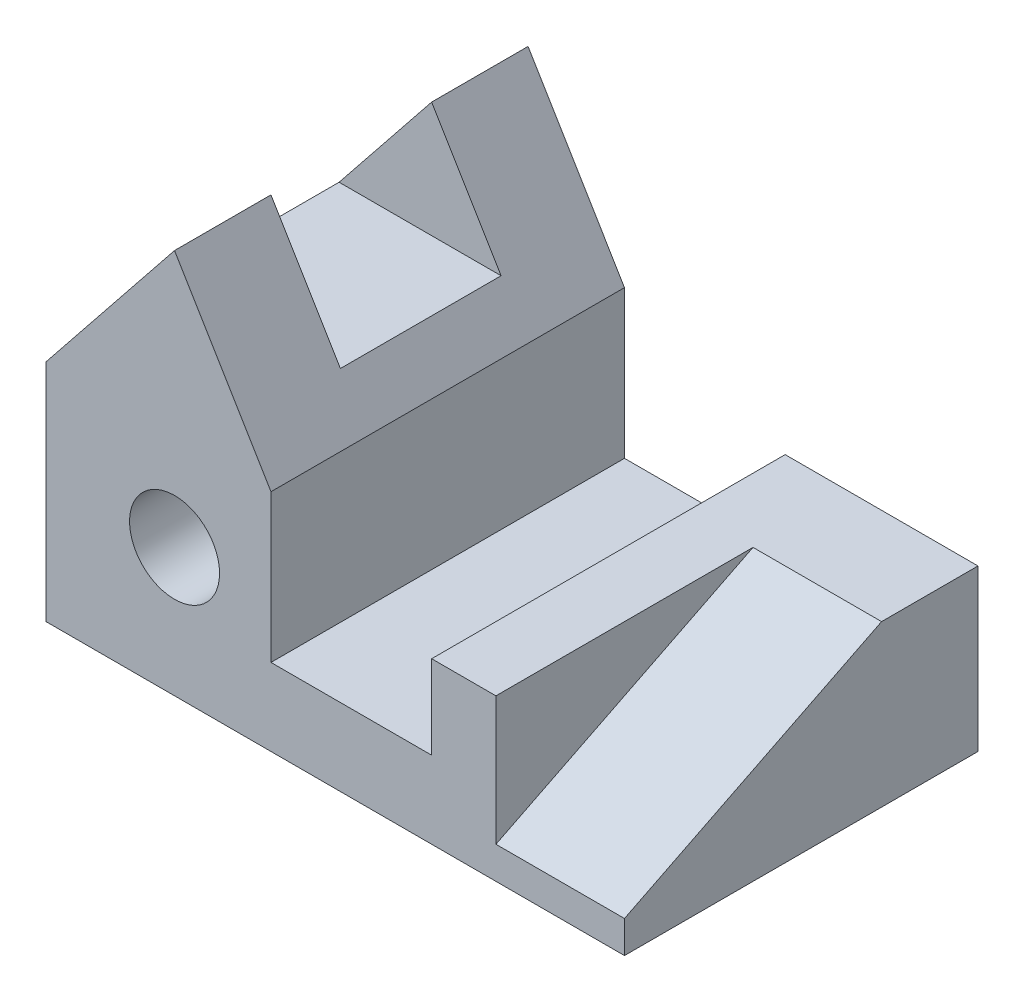
ISO-10303-21;
HEADER;
FILE_DESCRIPTION(('STEP AP214'),'2;1');
FILE_NAME('part.step','',(''),(''),'','','');
FILE_SCHEMA(('AUTOMOTIVE_DESIGN { 1 0 10303 214 1 1 1 1 }'));
ENDSEC;
DATA;
#1=APPLICATION_CONTEXT('core data for automotive mechanical design processes');
#2=APPLICATION_PROTOCOL_DEFINITION('international standard','automotive_design',2000,#1);
#3=PRODUCT_CONTEXT('',#1,'mechanical');
#4=PRODUCT('Part','Part','',(#3));
#5=PRODUCT_RELATED_PRODUCT_CATEGORY('part','',(#4));
#6=PRODUCT_DEFINITION_FORMATION('','',#4);
#7=PRODUCT_DEFINITION_CONTEXT('part definition',#1,'design');
#8=PRODUCT_DEFINITION('design','',#6,#7);
#9=PRODUCT_DEFINITION_SHAPE('','',#8);
#10=(LENGTH_UNIT() NAMED_UNIT(*) SI_UNIT(.MILLI.,.METRE.));
#11=(NAMED_UNIT(*) PLANE_ANGLE_UNIT() SI_UNIT($,.RADIAN.));
#12=(NAMED_UNIT(*) SI_UNIT($,.STERADIAN.) SOLID_ANGLE_UNIT());
#13=UNCERTAINTY_MEASURE_WITH_UNIT(LENGTH_MEASURE(1.E-05),#10,'distance_accuracy_value','');
#14=(GEOMETRIC_REPRESENTATION_CONTEXT(3) GLOBAL_UNCERTAINTY_ASSIGNED_CONTEXT((#13)) GLOBAL_UNIT_ASSIGNED_CONTEXT((#10,
#11,#12)) REPRESENTATION_CONTEXT('',''));
#15=CARTESIAN_POINT('',(0.,0.,0.));
#16=DIRECTION('',(0.,0.,1.));
#17=DIRECTION('',(1.,0.,0.));
#18=AXIS2_PLACEMENT_3D('',#15,#16,#17);
#19=CARTESIAN_POINT('',(60.,25.,55.));
#20=DIRECTION('',(0.,-1.,0.));
#21=DIRECTION('',(0.,0.,-1.));
#22=AXIS2_PLACEMENT_3D('',#19,#20,#21);
#23=PLANE('',#22);
#24=DIRECTION('',(-1.,0.,0.));
#25=VECTOR('',#24,1.);
#26=CARTESIAN_POINT('',(241.683263743895,25.,15.));
#27=LINE('',#26,#25);
#28=CARTESIAN_POINT('',(90.,25.,15.));
#29=VERTEX_POINT('',#28);
#30=CARTESIAN_POINT('',(70.,25.,15.));
#31=VERTEX_POINT('',#30);
#32=EDGE_CURVE('E60',#29,#31,#27,.T.);
#33=ORIENTED_EDGE('',*,*,#32,.F.);
#34=DIRECTION('',(0.,0.,-1.));
#35=VECTOR('',#34,1.);
#36=CARTESIAN_POINT('',(90.,25.,55.));
#37=LINE('',#36,#35);
#38=CARTESIAN_POINT('',(90.,25.,0.));
#39=VERTEX_POINT('',#38);
#40=EDGE_CURVE('E241',#29,#39,#37,.T.);
#41=ORIENTED_EDGE('',*,*,#40,.T.);
#42=DIRECTION('',(-1.,0.,0.));
#43=VECTOR('',#42,1.);
#44=CARTESIAN_POINT('',(60.,25.,0.));
#45=LINE('',#44,#43);
#46=CARTESIAN_POINT('',(60.,25.,0.));
#47=VERTEX_POINT('',#46);
#48=EDGE_CURVE('E208',#39,#47,#45,.T.);
#49=ORIENTED_EDGE('',*,*,#48,.T.);
#50=DIRECTION('',(0.,0.,-1.));
#51=VECTOR('',#50,1.);
#52=CARTESIAN_POINT('',(60.,25.,55.));
#53=LINE('',#52,#51);
#54=CARTESIAN_POINT('',(60.,25.,55.));
#55=VERTEX_POINT('',#54);
#56=EDGE_CURVE('E238',#55,#47,#53,.T.);
#57=ORIENTED_EDGE('',*,*,#56,.F.);
#58=DIRECTION('',(-1.,0.,0.));
#59=VECTOR('',#58,1.);
#60=CARTESIAN_POINT('',(60.,25.,55.));
#61=LINE('',#60,#59);
#62=CARTESIAN_POINT('',(70.,25.,55.));
#63=VERTEX_POINT('',#62);
#64=EDGE_CURVE('E188',#63,#55,#61,.T.);
#65=ORIENTED_EDGE('',*,*,#64,.F.);
#66=DIRECTION('',(0.,0.,-1.));
#67=VECTOR('',#66,1.);
#68=CARTESIAN_POINT('',(70.,25.,55.));
#69=LINE('',#68,#67);
#70=EDGE_CURVE('E156',#63,#31,#69,.T.);
#71=ORIENTED_EDGE('',*,*,#70,.T.);
#72=EDGE_LOOP('',(#33,#41,#49,#57,#65,#71));
#73=FACE_BOUND('',#72,.T.);
#74=ADVANCED_FACE('F37',(#73),#23,.F.);
#75=CARTESIAN_POINT('',(0.,0.,55.));
#76=DIRECTION('',(0.,0.,-1.));
#77=DIRECTION('',(-1.,0.,0.));
#78=AXIS2_PLACEMENT_3D('',#75,#76,#77);
#79=PLANE('',#78);
#80=DIRECTION('',(0.,1.,0.));
#81=VECTOR('',#80,1.);
#82=CARTESIAN_POINT('',(90.,25.,55.));
#83=LINE('',#82,#81);
#84=CARTESIAN_POINT('',(90.,0.,55.));
#85=VERTEX_POINT('',#84);
#86=CARTESIAN_POINT('',(90.,5.,55.));
#87=VERTEX_POINT('',#86);
#88=EDGE_CURVE('E184',#85,#87,#83,.T.);
#89=ORIENTED_EDGE('',*,*,#88,.T.);
#90=DIRECTION('',(-1.,0.,0.));
#91=VECTOR('',#90,1.);
#92=CARTESIAN_POINT('',(241.683263743895,5.,55.));
#93=LINE('',#92,#91);
#94=CARTESIAN_POINT('',(70.,5.,55.));
#95=VERTEX_POINT('',#94);
#96=EDGE_CURVE('E169',#87,#95,#93,.T.);
#97=ORIENTED_EDGE('',*,*,#96,.T.);
#98=DIRECTION('',(0.,1.,0.));
#99=VECTOR('',#98,1.);
#100=CARTESIAN_POINT('',(70.,25.,55.));
#101=LINE('',#100,#99);
#102=EDGE_CURVE('E159',#95,#63,#101,.T.);
#103=ORIENTED_EDGE('',*,*,#102,.T.);
#104=ORIENTED_EDGE('',*,*,#64,.T.);
#105=DIRECTION('',(0.,-1.,0.));
#106=VECTOR('',#105,1.);
#107=CARTESIAN_POINT('',(60.,12.,55.));
#108=LINE('',#107,#106);
#109=CARTESIAN_POINT('',(60.,12.,55.));
#110=VERTEX_POINT('',#109);
#111=EDGE_CURVE('E190',#55,#110,#108,.T.);
#112=ORIENTED_EDGE('',*,*,#111,.T.);
#113=DIRECTION('',(-1.,0.,0.));
#114=VECTOR('',#113,1.);
#115=CARTESIAN_POINT('',(35.,12.,55.));
#116=LINE('',#115,#114);
#117=CARTESIAN_POINT('',(35.,12.,55.));
#118=VERTEX_POINT('',#117);
#119=EDGE_CURVE('E192',#110,#118,#116,.T.);
#120=ORIENTED_EDGE('',*,*,#119,.T.);
#121=DIRECTION('',(0.,1.,0.));
#122=VECTOR('',#121,1.);
#123=CARTESIAN_POINT('',(35.,35.,55.));
#124=LINE('',#123,#122);
#125=CARTESIAN_POINT('',(35.,35.,55.));
#126=VERTEX_POINT('',#125);
#127=EDGE_CURVE('E194',#118,#126,#124,.T.);
#128=ORIENTED_EDGE('',*,*,#127,.T.);
#129=DIRECTION('',(-0.514495755427527,0.857492925712544,0.));
#130=VECTOR('',#129,1.);
#131=CARTESIAN_POINT('',(20.,60.,55.));
#132=LINE('',#131,#130);
#133=CARTESIAN_POINT('',(20.,60.,55.));
#134=VERTEX_POINT('',#133);
#135=EDGE_CURVE('E196',#126,#134,#132,.T.);
#136=ORIENTED_EDGE('',*,*,#135,.T.);
#137=DIRECTION('',(-0.624695047554424,-0.78086880944303,0.));
#138=VECTOR('',#137,1.);
#139=CARTESIAN_POINT('',(0.,35.,55.));
#140=LINE('',#139,#138);
#141=CARTESIAN_POINT('',(0.,35.,55.));
#142=VERTEX_POINT('',#141);
#143=EDGE_CURVE('E198',#134,#142,#140,.T.);
#144=ORIENTED_EDGE('',*,*,#143,.T.);
#145=DIRECTION('',(0.,-1.,0.));
#146=VECTOR('',#145,1.);
#147=CARTESIAN_POINT('',(0.,0.,55.));
#148=LINE('',#147,#146);
#149=CARTESIAN_POINT('',(0.,0.,55.));
#150=VERTEX_POINT('',#149);
#151=EDGE_CURVE('E200',#142,#150,#148,.T.);
#152=ORIENTED_EDGE('',*,*,#151,.T.);
#153=DIRECTION('',(1.,0.,0.));
#154=VECTOR('',#153,1.);
#155=CARTESIAN_POINT('',(90.,0.,55.));
#156=LINE('',#155,#154);
#157=EDGE_CURVE('E181',#150,#85,#156,.T.);
#158=ORIENTED_EDGE('',*,*,#157,.T.);
#159=EDGE_LOOP('',(#89,#97,#103,#104,#112,#120,#128,#136,#144,#152,#158));
#160=FACE_BOUND('',#159,.T.);
#161=CARTESIAN_POINT('',(20.,20.,55.));
#162=DIRECTION('',(0.,0.,1.));
#163=DIRECTION('',(1.,0.,0.));
#164=AXIS2_PLACEMENT_3D('',#161,#162,#163);
#165=CIRCLE('',#164,7.);
#166=CARTESIAN_POINT('',(27.,20.,55.));
#167=VERTEX_POINT('',#166);
#168=EDGE_CURVE('E175',#167,#167,#165,.T.);
#169=ORIENTED_EDGE('',*,*,#168,.F.);
#170=EDGE_LOOP('',(#169));
#171=FACE_BOUND('',#170,.T.);
#172=ADVANCED_FACE('F258',(#160,#171),#79,.F.);
#173=CARTESIAN_POINT('',(0.,0.,0.));
#174=DIRECTION('',(0.,0.,-1.));
#175=DIRECTION('',(-1.,0.,0.));
#176=AXIS2_PLACEMENT_3D('',#173,#174,#175);
#177=PLANE('',#176);
#178=DIRECTION('',(1.,0.,0.));
#179=VECTOR('',#178,1.);
#180=CARTESIAN_POINT('',(90.,0.,0.));
#181=LINE('',#180,#179);
#182=CARTESIAN_POINT('',(0.,0.,0.));
#183=VERTEX_POINT('',#182);
#184=CARTESIAN_POINT('',(90.,0.,0.));
#185=VERTEX_POINT('',#184);
#186=EDGE_CURVE('E178',#183,#185,#181,.T.);
#187=ORIENTED_EDGE('',*,*,#186,.F.);
#188=DIRECTION('',(0.,-1.,0.));
#189=VECTOR('',#188,1.);
#190=CARTESIAN_POINT('',(0.,0.,0.));
#191=LINE('',#190,#189);
#192=CARTESIAN_POINT('',(0.,35.,0.));
#193=VERTEX_POINT('',#192);
#194=EDGE_CURVE('E185',#193,#183,#191,.T.);
#195=ORIENTED_EDGE('',*,*,#194,.F.);
#196=DIRECTION('',(-0.624695047554424,-0.78086880944303,0.));
#197=VECTOR('',#196,1.);
#198=CARTESIAN_POINT('',(0.,35.,0.));
#199=LINE('',#198,#197);
#200=CARTESIAN_POINT('',(20.,60.,0.));
#201=VERTEX_POINT('',#200);
#202=EDGE_CURVE('E218',#201,#193,#199,.T.);
#203=ORIENTED_EDGE('',*,*,#202,.F.);
#204=DIRECTION('',(-0.514495755427527,0.857492925712544,0.));
#205=VECTOR('',#204,1.);
#206=CARTESIAN_POINT('',(20.,60.,0.));
#207=LINE('',#206,#205);
#208=CARTESIAN_POINT('',(35.,35.,0.));
#209=VERTEX_POINT('',#208);
#210=EDGE_CURVE('E216',#209,#201,#207,.T.);
#211=ORIENTED_EDGE('',*,*,#210,.F.);
#212=DIRECTION('',(0.,1.,0.));
#213=VECTOR('',#212,1.);
#214=CARTESIAN_POINT('',(35.,35.,0.));
#215=LINE('',#214,#213);
#216=CARTESIAN_POINT('',(35.,12.,0.));
#217=VERTEX_POINT('',#216);
#218=EDGE_CURVE('E214',#217,#209,#215,.T.);
#219=ORIENTED_EDGE('',*,*,#218,.F.);
#220=DIRECTION('',(-1.,0.,0.));
#221=VECTOR('',#220,1.);
#222=CARTESIAN_POINT('',(35.,12.,0.));
#223=LINE('',#222,#221);
#224=CARTESIAN_POINT('',(60.,12.,0.));
#225=VERTEX_POINT('',#224);
#226=EDGE_CURVE('E212',#225,#217,#223,.T.);
#227=ORIENTED_EDGE('',*,*,#226,.F.);
#228=DIRECTION('',(0.,-1.,0.));
#229=VECTOR('',#228,1.);
#230=CARTESIAN_POINT('',(60.,12.,0.));
#231=LINE('',#230,#229);
#232=EDGE_CURVE('E210',#47,#225,#231,.T.);
#233=ORIENTED_EDGE('',*,*,#232,.F.);
#234=ORIENTED_EDGE('',*,*,#48,.F.);
#235=DIRECTION('',(0.,1.,0.));
#236=VECTOR('',#235,1.);
#237=CARTESIAN_POINT('',(90.,25.,0.));
#238=LINE('',#237,#236);
#239=EDGE_CURVE('E205',#185,#39,#238,.T.);
#240=ORIENTED_EDGE('',*,*,#239,.F.);
#241=EDGE_LOOP('',(#187,#195,#203,#211,#219,#227,#233,#234,#240));
#242=FACE_BOUND('',#241,.T.);
#243=CARTESIAN_POINT('',(20.,20.,0.));
#244=DIRECTION('',(0.,0.,1.));
#245=DIRECTION('',(1.,0.,0.));
#246=AXIS2_PLACEMENT_3D('',#243,#244,#245);
#247=CIRCLE('',#246,7.);
#248=CARTESIAN_POINT('',(27.,20.,0.));
#249=VERTEX_POINT('',#248);
#250=EDGE_CURVE('E171',#249,#249,#247,.T.);
#251=ORIENTED_EDGE('',*,*,#250,.T.);
#252=EDGE_LOOP('',(#251));
#253=FACE_BOUND('',#252,.T.);
#254=ADVANCED_FACE('F272',(#242,#253),#177,.T.);
#255=CARTESIAN_POINT('',(90.,0.,55.));
#256=DIRECTION('',(0.,1.,0.));
#257=DIRECTION('',(0.,0.,1.));
#258=AXIS2_PLACEMENT_3D('',#255,#256,#257);
#259=PLANE('',#258);
#260=ORIENTED_EDGE('',*,*,#186,.T.);
#261=DIRECTION('',(0.,0.,-1.));
#262=VECTOR('',#261,1.);
#263=CARTESIAN_POINT('',(90.,0.,55.));
#264=LINE('',#263,#262);
#265=EDGE_CURVE('E243',#85,#185,#264,.T.);
#266=ORIENTED_EDGE('',*,*,#265,.F.);
#267=ORIENTED_EDGE('',*,*,#157,.F.);
#268=DIRECTION('',(0.,0.,-1.));
#269=VECTOR('',#268,1.);
#270=CARTESIAN_POINT('',(0.,0.,55.));
#271=LINE('',#270,#269);
#272=EDGE_CURVE('E202',#150,#183,#271,.T.);
#273=ORIENTED_EDGE('',*,*,#272,.T.);
#274=EDGE_LOOP('',(#260,#266,#267,#273));
#275=FACE_BOUND('',#274,.T.);
#276=ADVANCED_FACE('F39',(#275),#259,.F.);
#277=CARTESIAN_POINT('',(90.,25.,55.));
#278=DIRECTION('',(-1.,0.,0.));
#279=DIRECTION('',(0.,0.,1.));
#280=AXIS2_PLACEMENT_3D('',#277,#278,#279);
#281=PLANE('',#280);
#282=ORIENTED_EDGE('',*,*,#40,.F.);
#283=DIRECTION('',(0.,-0.447213595499958,0.894427190999916));
#284=VECTOR('',#283,1.);
#285=CARTESIAN_POINT('',(90.,5.,55.));
#286=LINE('',#285,#284);
#287=EDGE_CURVE('E165',#29,#87,#286,.T.);
#288=ORIENTED_EDGE('',*,*,#287,.T.);
#289=ORIENTED_EDGE('',*,*,#88,.F.);
#290=ORIENTED_EDGE('',*,*,#265,.T.);
#291=ORIENTED_EDGE('',*,*,#239,.T.);
#292=EDGE_LOOP('',(#282,#288,#289,#290,#291));
#293=FACE_BOUND('',#292,.T.);
#294=ADVANCED_FACE('F283',(#293),#281,.F.);
#295=CARTESIAN_POINT('',(60.,12.,55.));
#296=DIRECTION('',(1.,0.,0.));
#297=DIRECTION('',(0.,0.,-1.));
#298=AXIS2_PLACEMENT_3D('',#295,#296,#297);
#299=PLANE('',#298);
#300=ORIENTED_EDGE('',*,*,#232,.T.);
#301=DIRECTION('',(0.,0.,-1.));
#302=VECTOR('',#301,1.);
#303=CARTESIAN_POINT('',(60.,12.,55.));
#304=LINE('',#303,#302);
#305=EDGE_CURVE('E235',#110,#225,#304,.T.);
#306=ORIENTED_EDGE('',*,*,#305,.F.);
#307=ORIENTED_EDGE('',*,*,#111,.F.);
#308=ORIENTED_EDGE('',*,*,#56,.T.);
#309=EDGE_LOOP('',(#300,#306,#307,#308));
#310=FACE_BOUND('',#309,.T.);
#311=ADVANCED_FACE('F295',(#310),#299,.F.);
#312=CARTESIAN_POINT('',(35.,12.,55.));
#313=DIRECTION('',(0.,-1.,0.));
#314=DIRECTION('',(0.,0.,-1.));
#315=AXIS2_PLACEMENT_3D('',#312,#313,#314);
#316=PLANE('',#315);
#317=ORIENTED_EDGE('',*,*,#226,.T.);
#318=DIRECTION('',(0.,0.,-1.));
#319=VECTOR('',#318,1.);
#320=CARTESIAN_POINT('',(35.,12.,55.));
#321=LINE('',#320,#319);
#322=EDGE_CURVE('E232',#118,#217,#321,.T.);
#323=ORIENTED_EDGE('',*,*,#322,.F.);
#324=ORIENTED_EDGE('',*,*,#119,.F.);
#325=ORIENTED_EDGE('',*,*,#305,.T.);
#326=EDGE_LOOP('',(#317,#323,#324,#325));
#327=FACE_BOUND('',#326,.T.);
#328=ADVANCED_FACE('F297',(#327),#316,.F.);
#329=CARTESIAN_POINT('',(35.,35.,55.));
#330=DIRECTION('',(-1.,0.,0.));
#331=DIRECTION('',(0.,0.,1.));
#332=AXIS2_PLACEMENT_3D('',#329,#330,#331);
#333=PLANE('',#332);
#334=ORIENTED_EDGE('',*,*,#218,.T.);
#335=DIRECTION('',(0.,0.,-1.));
#336=VECTOR('',#335,1.);
#337=CARTESIAN_POINT('',(35.,35.,55.));
#338=LINE('',#337,#336);
#339=EDGE_CURVE('E229',#126,#209,#338,.T.);
#340=ORIENTED_EDGE('',*,*,#339,.F.);
#341=ORIENTED_EDGE('',*,*,#127,.F.);
#342=ORIENTED_EDGE('',*,*,#322,.T.);
#343=EDGE_LOOP('',(#334,#340,#341,#342));
#344=FACE_BOUND('',#343,.T.);
#345=ADVANCED_FACE('F266',(#344),#333,.F.);
#346=CARTESIAN_POINT('',(20.,60.,55.));
#347=DIRECTION('',(-0.857492925712544,-0.514495755427527,0.));
#348=DIRECTION('',(0.514495755427527,-0.857492925712544,0.));
#349=AXIS2_PLACEMENT_3D('',#346,#347,#348);
#350=PLANE('',#349);
#351=DIRECTION('',(0.,0.,-1.));
#352=VECTOR('',#351,1.);
#353=CARTESIAN_POINT('',(20.,60.,55.));
#354=LINE('',#353,#352);
#355=CARTESIAN_POINT('',(20.,60.,15.));
#356=VERTEX_POINT('',#355);
#357=EDGE_CURVE('E155',#356,#201,#354,.T.);
#358=ORIENTED_EDGE('',*,*,#357,.F.);
#359=DIRECTION('',(0.514495755427527,-0.857492925712544,0.));
#360=VECTOR('',#359,1.);
#361=CARTESIAN_POINT('',(20.,60.,15.));
#362=LINE('',#361,#360);
#363=CARTESIAN_POINT('',(30.8,42.,15.));
#364=VERTEX_POINT('',#363);
#365=EDGE_CURVE('E149',#356,#364,#362,.T.);
#366=ORIENTED_EDGE('',*,*,#365,.T.);
#367=DIRECTION('',(0.,0.,1.));
#368=VECTOR('',#367,1.);
#369=CARTESIAN_POINT('',(30.8,42.,55.));
#370=LINE('',#369,#368);
#371=CARTESIAN_POINT('',(30.8,42.,40.));
#372=VERTEX_POINT('',#371);
#373=EDGE_CURVE('E138',#364,#372,#370,.T.);
#374=ORIENTED_EDGE('',*,*,#373,.T.);
#375=DIRECTION('',(-0.514495755427527,0.857492925712544,0.));
#376=VECTOR('',#375,1.);
#377=CARTESIAN_POINT('',(20.,60.,40.));
#378=LINE('',#377,#376);
#379=CARTESIAN_POINT('',(20.,60.,40.));
#380=VERTEX_POINT('',#379);
#381=EDGE_CURVE('E145',#372,#380,#378,.T.);
#382=ORIENTED_EDGE('',*,*,#381,.T.);
#383=EDGE_CURVE('E226',#134,#380,#354,.T.);
#384=ORIENTED_EDGE('',*,*,#383,.F.);
#385=ORIENTED_EDGE('',*,*,#135,.F.);
#386=ORIENTED_EDGE('',*,*,#339,.T.);
#387=ORIENTED_EDGE('',*,*,#210,.T.);
#388=EDGE_LOOP('',(#358,#366,#374,#382,#384,#385,#386,#387));
#389=FACE_BOUND('',#388,.T.);
#390=ADVANCED_FACE('F153',(#389),#350,.F.);
#391=CARTESIAN_POINT('',(0.,35.,55.));
#392=DIRECTION('',(0.78086880944303,-0.624695047554424,0.));
#393=DIRECTION('',(0.624695047554424,0.78086880944303,0.));
#394=AXIS2_PLACEMENT_3D('',#391,#392,#393);
#395=PLANE('',#394);
#396=DIRECTION('',(0.,0.,-1.));
#397=VECTOR('',#396,1.);
#398=CARTESIAN_POINT('',(5.59999999999999,42.,55.));
#399=LINE('',#398,#397);
#400=CARTESIAN_POINT('',(5.60000000000002,42.,40.));
#401=VERTEX_POINT('',#400);
#402=CARTESIAN_POINT('',(5.59999999999999,42.,15.));
#403=VERTEX_POINT('',#402);
#404=EDGE_CURVE('E246',#401,#403,#399,.T.);
#405=ORIENTED_EDGE('',*,*,#404,.T.);
#406=DIRECTION('',(0.624695047554424,0.78086880944303,0.));
#407=VECTOR('',#406,1.);
#408=CARTESIAN_POINT('',(0.,35.,15.));
#409=LINE('',#408,#407);
#410=EDGE_CURVE('E11',#403,#356,#409,.T.);
#411=ORIENTED_EDGE('',*,*,#410,.T.);
#412=ORIENTED_EDGE('',*,*,#357,.T.);
#413=ORIENTED_EDGE('',*,*,#202,.T.);
#414=DIRECTION('',(0.,0.,-1.));
#415=VECTOR('',#414,1.);
#416=CARTESIAN_POINT('',(0.,35.,55.));
#417=LINE('',#416,#415);
#418=EDGE_CURVE('E223',#142,#193,#417,.T.);
#419=ORIENTED_EDGE('',*,*,#418,.F.);
#420=ORIENTED_EDGE('',*,*,#143,.F.);
#421=ORIENTED_EDGE('',*,*,#383,.T.);
#422=DIRECTION('',(-0.624695047554424,-0.78086880944303,0.));
#423=VECTOR('',#422,1.);
#424=CARTESIAN_POINT('',(0.,35.,40.));
#425=LINE('',#424,#423);
#426=EDGE_CURVE('E45',#380,#401,#425,.T.);
#427=ORIENTED_EDGE('',*,*,#426,.T.);
#428=EDGE_LOOP('',(#405,#411,#412,#413,#419,#420,#421,#427));
#429=FACE_BOUND('',#428,.T.);
#430=ADVANCED_FACE('F249',(#429),#395,.F.);
#431=CARTESIAN_POINT('',(0.,0.,55.));
#432=DIRECTION('',(1.,0.,0.));
#433=DIRECTION('',(0.,0.,-1.));
#434=AXIS2_PLACEMENT_3D('',#431,#432,#433);
#435=PLANE('',#434);
#436=ORIENTED_EDGE('',*,*,#194,.T.);
#437=ORIENTED_EDGE('',*,*,#272,.F.);
#438=ORIENTED_EDGE('',*,*,#151,.F.);
#439=ORIENTED_EDGE('',*,*,#418,.T.);
#440=EDGE_LOOP('',(#436,#437,#438,#439));
#441=FACE_BOUND('',#440,.T.);
#442=ADVANCED_FACE('F277',(#441),#435,.F.);
#443=CARTESIAN_POINT('',(20.,20.,55.));
#444=DIRECTION('',(0.,0.,-1.));
#445=DIRECTION('',(-1.,0.,0.));
#446=AXIS2_PLACEMENT_3D('',#443,#444,#445);
#447=CYLINDRICAL_SURFACE('',#446,7.);
#448=ORIENTED_EDGE('',*,*,#168,.T.);
#449=EDGE_LOOP('',(#448));
#450=FACE_BOUND('',#449,.T.);
#451=ORIENTED_EDGE('',*,*,#250,.F.);
#452=EDGE_LOOP('',(#451));
#453=FACE_BOUND('',#452,.T.);
#454=ADVANCED_FACE('F326',(#450,#453),#447,.F.);
#455=CARTESIAN_POINT('',(241.683263743895,5.,55.));
#456=DIRECTION('',(0.,0.894427190999916,0.447213595499958));
#457=DIRECTION('',(0.,-0.447213595499958,0.894427190999916));
#458=AXIS2_PLACEMENT_3D('',#455,#456,#457);
#459=PLANE('',#458);
#460=ORIENTED_EDGE('',*,*,#287,.F.);
#461=ORIENTED_EDGE('',*,*,#32,.T.);
#462=DIRECTION('',(0.,-0.447213595499958,0.894427190999916));
#463=VECTOR('',#462,1.);
#464=CARTESIAN_POINT('',(70.,5.,55.));
#465=LINE('',#464,#463);
#466=EDGE_CURVE('E163',#31,#95,#465,.T.);
#467=ORIENTED_EDGE('',*,*,#466,.T.);
#468=ORIENTED_EDGE('',*,*,#96,.F.);
#469=EDGE_LOOP('',(#460,#461,#467,#468));
#470=FACE_BOUND('',#469,.T.);
#471=ADVANCED_FACE('F284',(#470),#459,.T.);
#472=CARTESIAN_POINT('',(70.,25.,55.));
#473=DIRECTION('',(-1.,0.,0.));
#474=DIRECTION('',(0.,0.,1.));
#475=AXIS2_PLACEMENT_3D('',#472,#473,#474);
#476=PLANE('',#475);
#477=ORIENTED_EDGE('',*,*,#102,.F.);
#478=ORIENTED_EDGE('',*,*,#466,.F.);
#479=ORIENTED_EDGE('',*,*,#70,.F.);
#480=EDGE_LOOP('',(#477,#478,#479));
#481=FACE_BOUND('',#480,.T.);
#482=ADVANCED_FACE('F289',(#481),#476,.F.);
#483=CARTESIAN_POINT('',(90.,60.,15.));
#484=DIRECTION('',(0.,0.,-1.));
#485=DIRECTION('',(0.,1.,0.));
#486=AXIS2_PLACEMENT_3D('',#483,#484,#485);
#487=PLANE('',#486);
#488=ORIENTED_EDGE('',*,*,#410,.F.);
#489=DIRECTION('',(-1.,0.,0.));
#490=VECTOR('',#489,1.);
#491=CARTESIAN_POINT('',(90.,42.,15.));
#492=LINE('',#491,#490);
#493=EDGE_CURVE('E52',#364,#403,#492,.T.);
#494=ORIENTED_EDGE('',*,*,#493,.F.);
#495=ORIENTED_EDGE('',*,*,#365,.F.);
#496=EDGE_LOOP('',(#488,#494,#495));
#497=FACE_BOUND('',#496,.T.);
#498=ADVANCED_FACE('F148',(#497),#487,.F.);
#499=CARTESIAN_POINT('',(90.,60.,40.));
#500=DIRECTION('',(0.,0.,1.));
#501=DIRECTION('',(0.,-1.,0.));
#502=AXIS2_PLACEMENT_3D('',#499,#500,#501);
#503=PLANE('',#502);
#504=DIRECTION('',(-1.,0.,0.));
#505=VECTOR('',#504,1.);
#506=CARTESIAN_POINT('',(90.,42.,40.));
#507=LINE('',#506,#505);
#508=EDGE_CURVE('E141',#372,#401,#507,.T.);
#509=ORIENTED_EDGE('',*,*,#508,.T.);
#510=ORIENTED_EDGE('',*,*,#426,.F.);
#511=ORIENTED_EDGE('',*,*,#381,.F.);
#512=EDGE_LOOP('',(#509,#510,#511));
#513=FACE_BOUND('',#512,.T.);
#514=ADVANCED_FACE('F253',(#513),#503,.F.);
#515=CARTESIAN_POINT('',(90.,42.,15.));
#516=DIRECTION('',(0.,-1.,0.));
#517=DIRECTION('',(0.,0.,-1.));
#518=AXIS2_PLACEMENT_3D('',#515,#516,#517);
#519=PLANE('',#518);
#520=ORIENTED_EDGE('',*,*,#493,.T.);
#521=ORIENTED_EDGE('',*,*,#404,.F.);
#522=ORIENTED_EDGE('',*,*,#508,.F.);
#523=ORIENTED_EDGE('',*,*,#373,.F.);
#524=EDGE_LOOP('',(#520,#521,#522,#523));
#525=FACE_BOUND('',#524,.T.);
#526=ADVANCED_FACE('F139',(#525),#519,.F.);
#527=CLOSED_SHELL('',(#74,#172,#254,#276,#294,#311,#328,#345,#390,#430,#442,#454,#471,#482,#498,
#514,#526));
#528=MANIFOLD_SOLID_BREP('B2',#527);
#529=ADVANCED_BREP_SHAPE_REPRESENTATION('',(#18,#528),#14);
#530=SHAPE_DEFINITION_REPRESENTATION(#9,#529);
ENDSEC;
END-ISO-10303-21;
